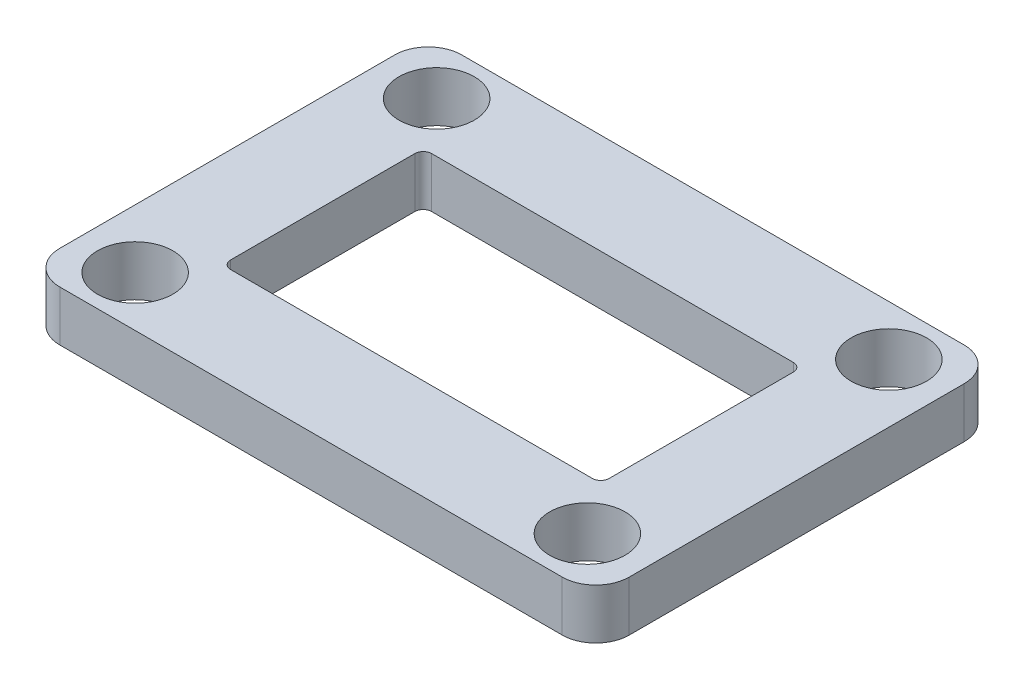
ISO-10303-21;
HEADER;
FILE_DESCRIPTION(('STEP AP214'),'2;1');
FILE_NAME('part.step','',(''),(''),'','','');
FILE_SCHEMA(('AUTOMOTIVE_DESIGN { 1 0 10303 214 1 1 1 1 }'));
ENDSEC;
DATA;
#1=APPLICATION_CONTEXT('core data for automotive mechanical design processes');
#2=APPLICATION_PROTOCOL_DEFINITION('international standard','automotive_design',2000,#1);
#3=PRODUCT_CONTEXT('',#1,'mechanical');
#4=PRODUCT('Part','Part','',(#3));
#5=PRODUCT_RELATED_PRODUCT_CATEGORY('part','',(#4));
#6=PRODUCT_DEFINITION_FORMATION('','',#4);
#7=PRODUCT_DEFINITION_CONTEXT('part definition',#1,'design');
#8=PRODUCT_DEFINITION('design','',#6,#7);
#9=PRODUCT_DEFINITION_SHAPE('','',#8);
#10=(LENGTH_UNIT() NAMED_UNIT(*) SI_UNIT(.MILLI.,.METRE.));
#11=(NAMED_UNIT(*) PLANE_ANGLE_UNIT() SI_UNIT($,.RADIAN.));
#12=(NAMED_UNIT(*) SI_UNIT($,.STERADIAN.) SOLID_ANGLE_UNIT());
#13=UNCERTAINTY_MEASURE_WITH_UNIT(LENGTH_MEASURE(1.E-05),#10,'distance_accuracy_value','');
#14=(GEOMETRIC_REPRESENTATION_CONTEXT(3) GLOBAL_UNCERTAINTY_ASSIGNED_CONTEXT((#13)) GLOBAL_UNIT_ASSIGNED_CONTEXT((#10,
#11,#12)) REPRESENTATION_CONTEXT('',''));
#15=CARTESIAN_POINT('',(0.,0.,0.));
#16=DIRECTION('',(0.,0.,1.));
#17=DIRECTION('',(1.,0.,0.));
#18=AXIS2_PLACEMENT_3D('',#15,#16,#17);
#19=CARTESIAN_POINT('',(0.,3.,0.));
#20=DIRECTION('',(0.,-1.,0.));
#21=DIRECTION('',(0.,0.,-1.));
#22=AXIS2_PLACEMENT_3D('',#19,#20,#21);
#23=PLANE('',#22);
#24=DIRECTION('',(0.,0.,-1.));
#25=VECTOR('',#24,1.);
#26=CARTESIAN_POINT('',(17.,3.,12.));
#27=LINE('',#26,#25);
#28=CARTESIAN_POINT('',(17.,3.,10.));
#29=VERTEX_POINT('',#28);
#30=CARTESIAN_POINT('',(17.,3.,-9.99999999999999));
#31=VERTEX_POINT('',#30);
#32=EDGE_CURVE('E262',#29,#31,#27,.T.);
#33=ORIENTED_EDGE('',*,*,#32,.T.);
#34=CARTESIAN_POINT('',(15.,3.,-10.));
#35=DIRECTION('',(0.,-1.,0.));
#36=DIRECTION('',(0.,0.,-1.));
#37=AXIS2_PLACEMENT_3D('',#34,#35,#36);
#38=CIRCLE('',#37,2.);
#39=CARTESIAN_POINT('',(15.,3.,-12.));
#40=VERTEX_POINT('',#39);
#41=EDGE_CURVE('E241',#31,#40,#38,.F.);
#42=ORIENTED_EDGE('',*,*,#41,.T.);
#43=DIRECTION('',(-1.,0.,0.));
#44=VECTOR('',#43,1.);
#45=CARTESIAN_POINT('',(-17.,3.,-12.));
#46=LINE('',#45,#44);
#47=CARTESIAN_POINT('',(-15.,3.,-12.));
#48=VERTEX_POINT('',#47);
#49=EDGE_CURVE('E270',#40,#48,#46,.T.);
#50=ORIENTED_EDGE('',*,*,#49,.T.);
#51=CARTESIAN_POINT('',(-15.,3.,-9.99999999999999));
#52=DIRECTION('',(0.,-1.,0.));
#53=DIRECTION('',(0.,0.,-1.));
#54=AXIS2_PLACEMENT_3D('',#51,#52,#53);
#55=CIRCLE('',#54,2.);
#56=CARTESIAN_POINT('',(-17.,3.,-9.99999999999999));
#57=VERTEX_POINT('',#56);
#58=EDGE_CURVE('E236',#48,#57,#55,.F.);
#59=ORIENTED_EDGE('',*,*,#58,.T.);
#60=DIRECTION('',(0.,0.,1.));
#61=VECTOR('',#60,1.);
#62=CARTESIAN_POINT('',(-17.,3.,12.));
#63=LINE('',#62,#61);
#64=CARTESIAN_POINT('',(-17.,3.,10.));
#65=VERTEX_POINT('',#64);
#66=EDGE_CURVE('E187',#57,#65,#63,.T.);
#67=ORIENTED_EDGE('',*,*,#66,.T.);
#68=CARTESIAN_POINT('',(-15.,3.,10.));
#69=DIRECTION('',(0.,-1.,0.));
#70=DIRECTION('',(0.,0.,-1.));
#71=AXIS2_PLACEMENT_3D('',#68,#69,#70);
#72=CIRCLE('',#71,2.);
#73=CARTESIAN_POINT('',(-15.,3.,12.));
#74=VERTEX_POINT('',#73);
#75=EDGE_CURVE('E65',#65,#74,#72,.F.);
#76=ORIENTED_EDGE('',*,*,#75,.T.);
#77=DIRECTION('',(1.,0.,0.));
#78=VECTOR('',#77,1.);
#79=CARTESIAN_POINT('',(-17.,3.,12.));
#80=LINE('',#79,#78);
#81=CARTESIAN_POINT('',(15.,3.,12.));
#82=VERTEX_POINT('',#81);
#83=EDGE_CURVE('E183',#74,#82,#80,.T.);
#84=ORIENTED_EDGE('',*,*,#83,.T.);
#85=CARTESIAN_POINT('',(15.,3.,10.));
#86=DIRECTION('',(0.,-1.,0.));
#87=DIRECTION('',(0.,0.,-1.));
#88=AXIS2_PLACEMENT_3D('',#85,#86,#87);
#89=CIRCLE('',#88,2.);
#90=EDGE_CURVE('E239',#82,#29,#89,.F.);
#91=ORIENTED_EDGE('',*,*,#90,.T.);
#92=EDGE_LOOP('',(#33,#42,#50,#59,#67,#76,#84,#91));
#93=FACE_BOUND('',#92,.T.);
#94=DIRECTION('',(0.,0.,-1.));
#95=VECTOR('',#94,1.);
#96=CARTESIAN_POINT('',(11.3,3.,6.));
#97=LINE('',#96,#95);
#98=CARTESIAN_POINT('',(11.3,3.,5.5));
#99=VERTEX_POINT('',#98);
#100=CARTESIAN_POINT('',(11.3,3.,-5.5));
#101=VERTEX_POINT('',#100);
#102=EDGE_CURVE('E179',#99,#101,#97,.T.);
#103=ORIENTED_EDGE('',*,*,#102,.F.);
#104=CARTESIAN_POINT('',(10.8,3.,5.5));
#105=DIRECTION('',(0.,-1.,0.));
#106=DIRECTION('',(0.,0.,-1.));
#107=AXIS2_PLACEMENT_3D('',#104,#105,#106);
#108=CIRCLE('',#107,0.5);
#109=CARTESIAN_POINT('',(10.8,3.,6.));
#110=VERTEX_POINT('',#109);
#111=EDGE_CURVE('E208',#99,#110,#108,.T.);
#112=ORIENTED_EDGE('',*,*,#111,.T.);
#113=DIRECTION('',(1.,0.,0.));
#114=VECTOR('',#113,1.);
#115=CARTESIAN_POINT('',(-11.3,3.,6.));
#116=LINE('',#115,#114);
#117=CARTESIAN_POINT('',(-10.8,3.,6.));
#118=VERTEX_POINT('',#117);
#119=EDGE_CURVE('E267',#118,#110,#116,.T.);
#120=ORIENTED_EDGE('',*,*,#119,.F.);
#121=CARTESIAN_POINT('',(-10.8,3.,5.5));
#122=DIRECTION('',(0.,-1.,0.));
#123=DIRECTION('',(0.,0.,-1.));
#124=AXIS2_PLACEMENT_3D('',#121,#122,#123);
#125=CIRCLE('',#124,0.5);
#126=CARTESIAN_POINT('',(-11.3,3.,5.5));
#127=VERTEX_POINT('',#126);
#128=EDGE_CURVE('E168',#118,#127,#125,.T.);
#129=ORIENTED_EDGE('',*,*,#128,.T.);
#130=DIRECTION('',(0.,0.,1.));
#131=VECTOR('',#130,1.);
#132=CARTESIAN_POINT('',(-11.3,3.,6.));
#133=LINE('',#132,#131);
#134=CARTESIAN_POINT('',(-11.3,3.,-5.5));
#135=VERTEX_POINT('',#134);
#136=EDGE_CURVE('E284',#135,#127,#133,.T.);
#137=ORIENTED_EDGE('',*,*,#136,.F.);
#138=CARTESIAN_POINT('',(-10.8,3.,-5.5));
#139=DIRECTION('',(0.,-1.,0.));
#140=DIRECTION('',(0.,0.,-1.));
#141=AXIS2_PLACEMENT_3D('',#138,#139,#140);
#142=CIRCLE('',#141,0.5);
#143=CARTESIAN_POINT('',(-10.8,3.,-6.));
#144=VERTEX_POINT('',#143);
#145=EDGE_CURVE('E169',#135,#144,#142,.T.);
#146=ORIENTED_EDGE('',*,*,#145,.T.);
#147=DIRECTION('',(-1.,0.,0.));
#148=VECTOR('',#147,1.);
#149=CARTESIAN_POINT('',(-11.3,3.,-6.));
#150=LINE('',#149,#148);
#151=CARTESIAN_POINT('',(10.8,3.,-6.));
#152=VERTEX_POINT('',#151);
#153=EDGE_CURVE('E287',#152,#144,#150,.T.);
#154=ORIENTED_EDGE('',*,*,#153,.F.);
#155=CARTESIAN_POINT('',(10.8,3.,-5.5));
#156=DIRECTION('',(0.,-1.,0.));
#157=DIRECTION('',(0.,0.,-1.));
#158=AXIS2_PLACEMENT_3D('',#155,#156,#157);
#159=CIRCLE('',#158,0.5);
#160=EDGE_CURVE('E212',#152,#101,#159,.T.);
#161=ORIENTED_EDGE('',*,*,#160,.T.);
#162=EDGE_LOOP('',(#103,#112,#120,#129,#137,#146,#154,#161));
#163=FACE_BOUND('',#162,.T.);
#164=CARTESIAN_POINT('',(-13.5,3.,-9.));
#165=DIRECTION('',(0.,1.,0.));
#166=DIRECTION('',(0.,0.,-1.));
#167=AXIS2_PLACEMENT_3D('',#164,#165,#166);
#168=CIRCLE('',#167,2.25);
#169=CARTESIAN_POINT('',(-13.5,3.,-11.25));
#170=VERTEX_POINT('',#169);
#171=EDGE_CURVE('E282',#170,#170,#168,.T.);
#172=ORIENTED_EDGE('',*,*,#171,.F.);
#173=EDGE_LOOP('',(#172));
#174=FACE_BOUND('',#173,.T.);
#175=CARTESIAN_POINT('',(13.5,3.,9.));
#176=DIRECTION('',(0.,1.,0.));
#177=DIRECTION('',(0.,0.,-1.));
#178=AXIS2_PLACEMENT_3D('',#175,#176,#177);
#179=CIRCLE('',#178,2.25);
#180=CARTESIAN_POINT('',(13.5,3.,6.75));
#181=VERTEX_POINT('',#180);
#182=EDGE_CURVE('E295',#181,#181,#179,.T.);
#183=ORIENTED_EDGE('',*,*,#182,.F.);
#184=EDGE_LOOP('',(#183));
#185=FACE_BOUND('',#184,.T.);
#186=CARTESIAN_POINT('',(13.5,3.,-9.00000000000001));
#187=DIRECTION('',(0.,1.,0.));
#188=DIRECTION('',(0.,0.,1.));
#189=AXIS2_PLACEMENT_3D('',#186,#187,#188);
#190=CIRCLE('',#189,2.25);
#191=CARTESIAN_POINT('',(13.5,3.,-6.75000000000001));
#192=VERTEX_POINT('',#191);
#193=EDGE_CURVE('E301',#192,#192,#190,.T.);
#194=ORIENTED_EDGE('',*,*,#193,.F.);
#195=EDGE_LOOP('',(#194));
#196=FACE_BOUND('',#195,.T.);
#197=CARTESIAN_POINT('',(-13.5,3.,9.));
#198=DIRECTION('',(0.,1.,0.));
#199=DIRECTION('',(0.,0.,1.));
#200=AXIS2_PLACEMENT_3D('',#197,#198,#199);
#201=CIRCLE('',#200,2.25);
#202=CARTESIAN_POINT('',(-13.5,3.,11.25));
#203=VERTEX_POINT('',#202);
#204=EDGE_CURVE('E307',#203,#203,#201,.T.);
#205=ORIENTED_EDGE('',*,*,#204,.F.);
#206=EDGE_LOOP('',(#205));
#207=FACE_BOUND('',#206,.T.);
#208=ADVANCED_FACE('F43',(#93,#163,#174,#185,#196,#207),#23,.F.);
#209=CARTESIAN_POINT('',(0.,0.,0.));
#210=DIRECTION('',(0.,-1.,0.));
#211=DIRECTION('',(0.,0.,-1.));
#212=AXIS2_PLACEMENT_3D('',#209,#210,#211);
#213=PLANE('',#212);
#214=CARTESIAN_POINT('',(13.5,0.,-9.00000000000001));
#215=DIRECTION('',(0.,1.,0.));
#216=DIRECTION('',(0.,0.,1.));
#217=AXIS2_PLACEMENT_3D('',#214,#215,#216);
#218=CIRCLE('',#217,2.25);
#219=CARTESIAN_POINT('',(13.5,0.,-6.75000000000001));
#220=VERTEX_POINT('',#219);
#221=EDGE_CURVE('E304',#220,#220,#218,.T.);
#222=ORIENTED_EDGE('',*,*,#221,.T.);
#223=EDGE_LOOP('',(#222));
#224=FACE_BOUND('',#223,.T.);
#225=CARTESIAN_POINT('',(-13.5,0.,-9.));
#226=DIRECTION('',(0.,1.,0.));
#227=DIRECTION('',(0.,0.,-1.));
#228=AXIS2_PLACEMENT_3D('',#225,#226,#227);
#229=CIRCLE('',#228,2.25);
#230=CARTESIAN_POINT('',(-13.5,0.,-11.25));
#231=VERTEX_POINT('',#230);
#232=EDGE_CURVE('E292',#231,#231,#229,.T.);
#233=ORIENTED_EDGE('',*,*,#232,.T.);
#234=EDGE_LOOP('',(#233));
#235=FACE_BOUND('',#234,.T.);
#236=DIRECTION('',(-1.,0.,0.));
#237=VECTOR('',#236,1.);
#238=CARTESIAN_POINT('',(-17.,0.,-12.));
#239=LINE('',#238,#237);
#240=CARTESIAN_POINT('',(15.,0.,-12.));
#241=VERTEX_POINT('',#240);
#242=CARTESIAN_POINT('',(-15.,0.,-12.));
#243=VERTEX_POINT('',#242);
#244=EDGE_CURVE('E261',#241,#243,#239,.T.);
#245=ORIENTED_EDGE('',*,*,#244,.F.);
#246=CARTESIAN_POINT('',(15.,0.,-10.));
#247=DIRECTION('',(0.,-1.,0.));
#248=DIRECTION('',(0.,0.,-1.));
#249=AXIS2_PLACEMENT_3D('',#246,#247,#248);
#250=CIRCLE('',#249,2.);
#251=CARTESIAN_POINT('',(17.,0.,-9.99999999999999));
#252=VERTEX_POINT('',#251);
#253=EDGE_CURVE('E229',#241,#252,#250,.T.);
#254=ORIENTED_EDGE('',*,*,#253,.T.);
#255=DIRECTION('',(0.,0.,-1.));
#256=VECTOR('',#255,1.);
#257=CARTESIAN_POINT('',(17.,0.,12.));
#258=LINE('',#257,#256);
#259=CARTESIAN_POINT('',(17.,0.,10.));
#260=VERTEX_POINT('',#259);
#261=EDGE_CURVE('E263',#260,#252,#258,.T.);
#262=ORIENTED_EDGE('',*,*,#261,.F.);
#263=CARTESIAN_POINT('',(15.,0.,10.));
#264=DIRECTION('',(0.,-1.,0.));
#265=DIRECTION('',(0.,0.,-1.));
#266=AXIS2_PLACEMENT_3D('',#263,#264,#265);
#267=CIRCLE('',#266,2.);
#268=CARTESIAN_POINT('',(15.,0.,12.));
#269=VERTEX_POINT('',#268);
#270=EDGE_CURVE('E227',#260,#269,#267,.T.);
#271=ORIENTED_EDGE('',*,*,#270,.T.);
#272=DIRECTION('',(1.,0.,0.));
#273=VECTOR('',#272,1.);
#274=CARTESIAN_POINT('',(-17.,0.,12.));
#275=LINE('',#274,#273);
#276=CARTESIAN_POINT('',(-15.,0.,12.));
#277=VERTEX_POINT('',#276);
#278=EDGE_CURVE('E190',#277,#269,#275,.T.);
#279=ORIENTED_EDGE('',*,*,#278,.F.);
#280=CARTESIAN_POINT('',(-15.,0.,10.));
#281=DIRECTION('',(0.,-1.,0.));
#282=DIRECTION('',(0.,0.,-1.));
#283=AXIS2_PLACEMENT_3D('',#280,#281,#282);
#284=CIRCLE('',#283,2.);
#285=CARTESIAN_POINT('',(-17.,0.,10.));
#286=VERTEX_POINT('',#285);
#287=EDGE_CURVE('E225',#277,#286,#284,.T.);
#288=ORIENTED_EDGE('',*,*,#287,.T.);
#289=DIRECTION('',(0.,0.,1.));
#290=VECTOR('',#289,1.);
#291=CARTESIAN_POINT('',(-17.,0.,12.));
#292=LINE('',#291,#290);
#293=CARTESIAN_POINT('',(-17.,0.,-9.99999999999999));
#294=VERTEX_POINT('',#293);
#295=EDGE_CURVE('E253',#294,#286,#292,.T.);
#296=ORIENTED_EDGE('',*,*,#295,.F.);
#297=CARTESIAN_POINT('',(-15.,0.,-9.99999999999999));
#298=DIRECTION('',(0.,-1.,0.));
#299=DIRECTION('',(0.,0.,-1.));
#300=AXIS2_PLACEMENT_3D('',#297,#298,#299);
#301=CIRCLE('',#300,2.);
#302=EDGE_CURVE('E223',#294,#243,#301,.T.);
#303=ORIENTED_EDGE('',*,*,#302,.T.);
#304=EDGE_LOOP('',(#245,#254,#262,#271,#279,#288,#296,#303));
#305=FACE_BOUND('',#304,.T.);
#306=DIRECTION('',(0.,0.,1.));
#307=VECTOR('',#306,1.);
#308=CARTESIAN_POINT('',(-11.3,0.,6.));
#309=LINE('',#308,#307);
#310=CARTESIAN_POINT('',(-11.3,0.,-5.5));
#311=VERTEX_POINT('',#310);
#312=CARTESIAN_POINT('',(-11.3,0.,5.5));
#313=VERTEX_POINT('',#312);
#314=EDGE_CURVE('E163',#311,#313,#309,.T.);
#315=ORIENTED_EDGE('',*,*,#314,.T.);
#316=CARTESIAN_POINT('',(-10.8,0.,5.5));
#317=DIRECTION('',(0.,-1.,0.));
#318=DIRECTION('',(0.,0.,-1.));
#319=AXIS2_PLACEMENT_3D('',#316,#317,#318);
#320=CIRCLE('',#319,0.5);
#321=CARTESIAN_POINT('',(-10.8,0.,6.));
#322=VERTEX_POINT('',#321);
#323=EDGE_CURVE('E157',#313,#322,#320,.F.);
#324=ORIENTED_EDGE('',*,*,#323,.T.);
#325=DIRECTION('',(1.,0.,0.));
#326=VECTOR('',#325,1.);
#327=CARTESIAN_POINT('',(-11.3,0.,6.));
#328=LINE('',#327,#326);
#329=CARTESIAN_POINT('',(10.8,0.,6.));
#330=VERTEX_POINT('',#329);
#331=EDGE_CURVE('E161',#322,#330,#328,.T.);
#332=ORIENTED_EDGE('',*,*,#331,.T.);
#333=CARTESIAN_POINT('',(10.8,0.,5.5));
#334=DIRECTION('',(0.,-1.,0.));
#335=DIRECTION('',(0.,0.,-1.));
#336=AXIS2_PLACEMENT_3D('',#333,#334,#335);
#337=CIRCLE('',#336,0.5);
#338=CARTESIAN_POINT('',(11.3,0.,5.5));
#339=VERTEX_POINT('',#338);
#340=EDGE_CURVE('E206',#330,#339,#337,.F.);
#341=ORIENTED_EDGE('',*,*,#340,.T.);
#342=DIRECTION('',(0.,0.,-1.));
#343=VECTOR('',#342,1.);
#344=CARTESIAN_POINT('',(11.3,0.,6.));
#345=LINE('',#344,#343);
#346=CARTESIAN_POINT('',(11.3,0.,-5.5));
#347=VERTEX_POINT('',#346);
#348=EDGE_CURVE('E279',#339,#347,#345,.T.);
#349=ORIENTED_EDGE('',*,*,#348,.T.);
#350=CARTESIAN_POINT('',(10.8,0.,-5.5));
#351=DIRECTION('',(0.,-1.,0.));
#352=DIRECTION('',(0.,0.,-1.));
#353=AXIS2_PLACEMENT_3D('',#350,#351,#352);
#354=CIRCLE('',#353,0.5);
#355=CARTESIAN_POINT('',(10.8,0.,-6.));
#356=VERTEX_POINT('',#355);
#357=EDGE_CURVE('E210',#347,#356,#354,.F.);
#358=ORIENTED_EDGE('',*,*,#357,.T.);
#359=DIRECTION('',(-1.,0.,0.));
#360=VECTOR('',#359,1.);
#361=CARTESIAN_POINT('',(-11.3,0.,-6.));
#362=LINE('',#361,#360);
#363=CARTESIAN_POINT('',(-10.8,0.,-6.));
#364=VERTEX_POINT('',#363);
#365=EDGE_CURVE('E276',#356,#364,#362,.T.);
#366=ORIENTED_EDGE('',*,*,#365,.T.);
#367=CARTESIAN_POINT('',(-10.8,0.,-5.5));
#368=DIRECTION('',(0.,-1.,0.));
#369=DIRECTION('',(0.,0.,-1.));
#370=AXIS2_PLACEMENT_3D('',#367,#368,#369);
#371=CIRCLE('',#370,0.5);
#372=EDGE_CURVE('E214',#364,#311,#371,.F.);
#373=ORIENTED_EDGE('',*,*,#372,.T.);
#374=EDGE_LOOP('',(#315,#324,#332,#341,#349,#358,#366,#373));
#375=FACE_BOUND('',#374,.T.);
#376=CARTESIAN_POINT('',(13.5,0.,9.));
#377=DIRECTION('',(0.,1.,0.));
#378=DIRECTION('',(0.,0.,-1.));
#379=AXIS2_PLACEMENT_3D('',#376,#377,#378);
#380=CIRCLE('',#379,2.25);
#381=CARTESIAN_POINT('',(13.5,0.,6.75));
#382=VERTEX_POINT('',#381);
#383=EDGE_CURVE('E298',#382,#382,#380,.T.);
#384=ORIENTED_EDGE('',*,*,#383,.T.);
#385=EDGE_LOOP('',(#384));
#386=FACE_BOUND('',#385,.T.);
#387=CARTESIAN_POINT('',(-13.5,0.,9.));
#388=DIRECTION('',(0.,1.,0.));
#389=DIRECTION('',(0.,0.,1.));
#390=AXIS2_PLACEMENT_3D('',#387,#388,#389);
#391=CIRCLE('',#390,2.25);
#392=CARTESIAN_POINT('',(-13.5,0.,11.25));
#393=VERTEX_POINT('',#392);
#394=EDGE_CURVE('E310',#393,#393,#391,.T.);
#395=ORIENTED_EDGE('',*,*,#394,.T.);
#396=EDGE_LOOP('',(#395));
#397=FACE_BOUND('',#396,.T.);
#398=ADVANCED_FACE('F159',(#224,#235,#305,#375,#386,#397),#213,.T.);
#399=CARTESIAN_POINT('',(17.,3.,12.));
#400=DIRECTION('',(-1.,0.,0.));
#401=DIRECTION('',(0.,0.,1.));
#402=AXIS2_PLACEMENT_3D('',#399,#400,#401);
#403=PLANE('',#402);
#404=ORIENTED_EDGE('',*,*,#261,.T.);
#405=DIRECTION('',(0.,-1.,0.));
#406=VECTOR('',#405,1.);
#407=CARTESIAN_POINT('',(17.,3.,-9.99999999999999));
#408=LINE('',#407,#406);
#409=EDGE_CURVE('E234',#252,#31,#408,.F.);
#410=ORIENTED_EDGE('',*,*,#409,.T.);
#411=ORIENTED_EDGE('',*,*,#32,.F.);
#412=DIRECTION('',(0.,-1.,0.));
#413=VECTOR('',#412,1.);
#414=CARTESIAN_POINT('',(17.,3.,10.));
#415=LINE('',#414,#413);
#416=EDGE_CURVE('E231',#29,#260,#415,.T.);
#417=ORIENTED_EDGE('',*,*,#416,.T.);
#418=EDGE_LOOP('',(#404,#410,#411,#417));
#419=FACE_BOUND('',#418,.T.);
#420=ADVANCED_FACE('F325',(#419),#403,.F.);
#421=CARTESIAN_POINT('',(-17.,3.,-12.));
#422=DIRECTION('',(0.,0.,1.));
#423=DIRECTION('',(1.,0.,0.));
#424=AXIS2_PLACEMENT_3D('',#421,#422,#423);
#425=PLANE('',#424);
#426=ORIENTED_EDGE('',*,*,#49,.F.);
#427=DIRECTION('',(0.,-1.,0.));
#428=VECTOR('',#427,1.);
#429=CARTESIAN_POINT('',(15.,3.,-12.));
#430=LINE('',#429,#428);
#431=EDGE_CURVE('E220',#40,#241,#430,.T.);
#432=ORIENTED_EDGE('',*,*,#431,.T.);
#433=ORIENTED_EDGE('',*,*,#244,.T.);
#434=DIRECTION('',(0.,-1.,0.));
#435=VECTOR('',#434,1.);
#436=CARTESIAN_POINT('',(-15.,3.,-12.));
#437=LINE('',#436,#435);
#438=EDGE_CURVE('E218',#243,#48,#437,.F.);
#439=ORIENTED_EDGE('',*,*,#438,.T.);
#440=EDGE_LOOP('',(#426,#432,#433,#439));
#441=FACE_BOUND('',#440,.T.);
#442=ADVANCED_FACE('F338',(#441),#425,.F.);
#443=CARTESIAN_POINT('',(-17.,3.,12.));
#444=DIRECTION('',(1.,0.,0.));
#445=DIRECTION('',(0.,0.,-1.));
#446=AXIS2_PLACEMENT_3D('',#443,#444,#445);
#447=PLANE('',#446);
#448=ORIENTED_EDGE('',*,*,#295,.T.);
#449=DIRECTION('',(0.,-1.,0.));
#450=VECTOR('',#449,1.);
#451=CARTESIAN_POINT('',(-17.,3.,10.));
#452=LINE('',#451,#450);
#453=EDGE_CURVE('E11',#286,#65,#452,.F.);
#454=ORIENTED_EDGE('',*,*,#453,.T.);
#455=ORIENTED_EDGE('',*,*,#66,.F.);
#456=DIRECTION('',(0.,-1.,0.));
#457=VECTOR('',#456,1.);
#458=CARTESIAN_POINT('',(-17.,3.,-9.99999999999999));
#459=LINE('',#458,#457);
#460=EDGE_CURVE('E51',#57,#294,#459,.T.);
#461=ORIENTED_EDGE('',*,*,#460,.T.);
#462=EDGE_LOOP('',(#448,#454,#455,#461));
#463=FACE_BOUND('',#462,.T.);
#464=ADVANCED_FACE('F252',(#463),#447,.F.);
#465=CARTESIAN_POINT('',(-17.,3.,12.));
#466=DIRECTION('',(0.,0.,-1.));
#467=DIRECTION('',(-1.,0.,0.));
#468=AXIS2_PLACEMENT_3D('',#465,#466,#467);
#469=PLANE('',#468);
#470=ORIENTED_EDGE('',*,*,#278,.T.);
#471=DIRECTION('',(0.,-1.,0.));
#472=VECTOR('',#471,1.);
#473=CARTESIAN_POINT('',(15.,3.,12.));
#474=LINE('',#473,#472);
#475=EDGE_CURVE('E58',#269,#82,#474,.F.);
#476=ORIENTED_EDGE('',*,*,#475,.T.);
#477=ORIENTED_EDGE('',*,*,#83,.F.);
#478=DIRECTION('',(0.,-1.,0.));
#479=VECTOR('',#478,1.);
#480=CARTESIAN_POINT('',(-15.,3.,12.));
#481=LINE('',#480,#479);
#482=EDGE_CURVE('E243',#74,#277,#481,.T.);
#483=ORIENTED_EDGE('',*,*,#482,.T.);
#484=EDGE_LOOP('',(#470,#476,#477,#483));
#485=FACE_BOUND('',#484,.T.);
#486=ADVANCED_FACE('F333',(#485),#469,.F.);
#487=CARTESIAN_POINT('',(11.3,3.,6.));
#488=DIRECTION('',(-1.,0.,0.));
#489=DIRECTION('',(0.,0.,1.));
#490=AXIS2_PLACEMENT_3D('',#487,#488,#489);
#491=PLANE('',#490);
#492=ORIENTED_EDGE('',*,*,#348,.F.);
#493=DIRECTION('',(0.,-1.,0.));
#494=VECTOR('',#493,1.);
#495=CARTESIAN_POINT('',(11.3,3.,5.5));
#496=LINE('',#495,#494);
#497=EDGE_CURVE('E195',#339,#99,#496,.F.);
#498=ORIENTED_EDGE('',*,*,#497,.T.);
#499=ORIENTED_EDGE('',*,*,#102,.T.);
#500=DIRECTION('',(0.,-1.,0.));
#501=VECTOR('',#500,1.);
#502=CARTESIAN_POINT('',(11.3,0.,-5.5));
#503=LINE('',#502,#501);
#504=EDGE_CURVE('E185',#101,#347,#503,.T.);
#505=ORIENTED_EDGE('',*,*,#504,.T.);
#506=EDGE_LOOP('',(#492,#498,#499,#505));
#507=FACE_BOUND('',#506,.T.);
#508=ADVANCED_FACE('F330',(#507),#491,.T.);
#509=CARTESIAN_POINT('',(-11.3,3.,-6.));
#510=DIRECTION('',(0.,0.,1.));
#511=DIRECTION('',(1.,0.,0.));
#512=AXIS2_PLACEMENT_3D('',#509,#510,#511);
#513=PLANE('',#512);
#514=ORIENTED_EDGE('',*,*,#365,.F.);
#515=DIRECTION('',(0.,-1.,0.));
#516=VECTOR('',#515,1.);
#517=CARTESIAN_POINT('',(10.8,3.,-6.));
#518=LINE('',#517,#516);
#519=EDGE_CURVE('E200',#356,#152,#518,.F.);
#520=ORIENTED_EDGE('',*,*,#519,.T.);
#521=ORIENTED_EDGE('',*,*,#153,.T.);
#522=DIRECTION('',(0.,-1.,0.));
#523=VECTOR('',#522,1.);
#524=CARTESIAN_POINT('',(-10.8,0.,-6.));
#525=LINE('',#524,#523);
#526=EDGE_CURVE('E197',#144,#364,#525,.T.);
#527=ORIENTED_EDGE('',*,*,#526,.T.);
#528=EDGE_LOOP('',(#514,#520,#521,#527));
#529=FACE_BOUND('',#528,.T.);
#530=ADVANCED_FACE('F481',(#529),#513,.T.);
#531=CARTESIAN_POINT('',(-11.3,3.,6.));
#532=DIRECTION('',(1.,0.,0.));
#533=DIRECTION('',(0.,0.,-1.));
#534=AXIS2_PLACEMENT_3D('',#531,#532,#533);
#535=PLANE('',#534);
#536=ORIENTED_EDGE('',*,*,#314,.F.);
#537=DIRECTION('',(0.,-1.,0.));
#538=VECTOR('',#537,1.);
#539=CARTESIAN_POINT('',(-11.3,3.,-5.5));
#540=LINE('',#539,#538);
#541=EDGE_CURVE('E204',#311,#135,#540,.F.);
#542=ORIENTED_EDGE('',*,*,#541,.T.);
#543=ORIENTED_EDGE('',*,*,#136,.T.);
#544=DIRECTION('',(0.,-1.,0.));
#545=VECTOR('',#544,1.);
#546=CARTESIAN_POINT('',(-11.3,0.,5.5));
#547=LINE('',#546,#545);
#548=EDGE_CURVE('E202',#127,#313,#547,.T.);
#549=ORIENTED_EDGE('',*,*,#548,.T.);
#550=EDGE_LOOP('',(#536,#542,#543,#549));
#551=FACE_BOUND('',#550,.T.);
#552=ADVANCED_FACE('F472',(#551),#535,.T.);
#553=CARTESIAN_POINT('',(-11.3,3.,6.));
#554=DIRECTION('',(0.,0.,-1.));
#555=DIRECTION('',(-1.,0.,0.));
#556=AXIS2_PLACEMENT_3D('',#553,#554,#555);
#557=PLANE('',#556);
#558=ORIENTED_EDGE('',*,*,#119,.T.);
#559=DIRECTION('',(0.,-1.,0.));
#560=VECTOR('',#559,1.);
#561=CARTESIAN_POINT('',(10.8,0.,6.));
#562=LINE('',#561,#560);
#563=EDGE_CURVE('E178',#110,#330,#562,.T.);
#564=ORIENTED_EDGE('',*,*,#563,.T.);
#565=ORIENTED_EDGE('',*,*,#331,.F.);
#566=DIRECTION('',(0.,-1.,0.));
#567=VECTOR('',#566,1.);
#568=CARTESIAN_POINT('',(-10.8,3.,6.));
#569=LINE('',#568,#567);
#570=EDGE_CURVE('E175',#322,#118,#569,.F.);
#571=ORIENTED_EDGE('',*,*,#570,.T.);
#572=EDGE_LOOP('',(#558,#564,#565,#571));
#573=FACE_BOUND('',#572,.T.);
#574=ADVANCED_FACE('F174',(#573),#557,.T.);
#575=CARTESIAN_POINT('',(-13.5,3.,-9.));
#576=DIRECTION('',(0.,-1.,0.));
#577=DIRECTION('',(0.,0.,-1.));
#578=AXIS2_PLACEMENT_3D('',#575,#576,#577);
#579=CYLINDRICAL_SURFACE('',#578,2.25);
#580=ORIENTED_EDGE('',*,*,#171,.T.);
#581=EDGE_LOOP('',(#580));
#582=FACE_BOUND('',#581,.T.);
#583=ORIENTED_EDGE('',*,*,#232,.F.);
#584=EDGE_LOOP('',(#583));
#585=FACE_BOUND('',#584,.T.);
#586=ADVANCED_FACE('F454',(#582,#585),#579,.F.);
#587=CARTESIAN_POINT('',(13.5,3.,9.));
#588=DIRECTION('',(0.,-1.,0.));
#589=DIRECTION('',(0.,0.,-1.));
#590=AXIS2_PLACEMENT_3D('',#587,#588,#589);
#591=CYLINDRICAL_SURFACE('',#590,2.25);
#592=ORIENTED_EDGE('',*,*,#182,.T.);
#593=EDGE_LOOP('',(#592));
#594=FACE_BOUND('',#593,.T.);
#595=ORIENTED_EDGE('',*,*,#383,.F.);
#596=EDGE_LOOP('',(#595));
#597=FACE_BOUND('',#596,.T.);
#598=ADVANCED_FACE('F444',(#594,#597),#591,.F.);
#599=CARTESIAN_POINT('',(13.5,3.,-9.00000000000001));
#600=DIRECTION('',(0.,-1.,0.));
#601=DIRECTION('',(0.,0.,-1.));
#602=AXIS2_PLACEMENT_3D('',#599,#600,#601);
#603=CYLINDRICAL_SURFACE('',#602,2.25);
#604=ORIENTED_EDGE('',*,*,#193,.T.);
#605=EDGE_LOOP('',(#604));
#606=FACE_BOUND('',#605,.T.);
#607=ORIENTED_EDGE('',*,*,#221,.F.);
#608=EDGE_LOOP('',(#607));
#609=FACE_BOUND('',#608,.T.);
#610=ADVANCED_FACE('F434',(#606,#609),#603,.F.);
#611=CARTESIAN_POINT('',(-13.5,3.,9.));
#612=DIRECTION('',(0.,-1.,0.));
#613=DIRECTION('',(0.,0.,-1.));
#614=AXIS2_PLACEMENT_3D('',#611,#612,#613);
#615=CYLINDRICAL_SURFACE('',#614,2.25);
#616=ORIENTED_EDGE('',*,*,#204,.T.);
#617=EDGE_LOOP('',(#616));
#618=FACE_BOUND('',#617,.T.);
#619=ORIENTED_EDGE('',*,*,#394,.F.);
#620=EDGE_LOOP('',(#619));
#621=FACE_BOUND('',#620,.T.);
#622=ADVANCED_FACE('F316',(#618,#621),#615,.F.);
#623=CARTESIAN_POINT('',(10.8,3.,5.5));
#624=DIRECTION('',(0.,1.,0.));
#625=DIRECTION('',(0.,0.,1.));
#626=AXIS2_PLACEMENT_3D('',#623,#624,#625);
#627=CYLINDRICAL_SURFACE('',#626,0.5);
#628=ORIENTED_EDGE('',*,*,#111,.F.);
#629=ORIENTED_EDGE('',*,*,#497,.F.);
#630=ORIENTED_EDGE('',*,*,#340,.F.);
#631=ORIENTED_EDGE('',*,*,#563,.F.);
#632=EDGE_LOOP('',(#628,#629,#630,#631));
#633=FACE_BOUND('',#632,.T.);
#634=ADVANCED_FACE('F345',(#633),#627,.F.);
#635=CARTESIAN_POINT('',(10.8,3.,-5.5));
#636=DIRECTION('',(0.,1.,0.));
#637=DIRECTION('',(0.,0.,1.));
#638=AXIS2_PLACEMENT_3D('',#635,#636,#637);
#639=CYLINDRICAL_SURFACE('',#638,0.5);
#640=ORIENTED_EDGE('',*,*,#160,.F.);
#641=ORIENTED_EDGE('',*,*,#519,.F.);
#642=ORIENTED_EDGE('',*,*,#357,.F.);
#643=ORIENTED_EDGE('',*,*,#504,.F.);
#644=EDGE_LOOP('',(#640,#641,#642,#643));
#645=FACE_BOUND('',#644,.T.);
#646=ADVANCED_FACE('F348',(#645),#639,.F.);
#647=CARTESIAN_POINT('',(-10.8,3.,-5.5));
#648=DIRECTION('',(0.,1.,0.));
#649=DIRECTION('',(0.,0.,1.));
#650=AXIS2_PLACEMENT_3D('',#647,#648,#649);
#651=CYLINDRICAL_SURFACE('',#650,0.5);
#652=ORIENTED_EDGE('',*,*,#145,.F.);
#653=ORIENTED_EDGE('',*,*,#541,.F.);
#654=ORIENTED_EDGE('',*,*,#372,.F.);
#655=ORIENTED_EDGE('',*,*,#526,.F.);
#656=EDGE_LOOP('',(#652,#653,#654,#655));
#657=FACE_BOUND('',#656,.T.);
#658=ADVANCED_FACE('F352',(#657),#651,.F.);
#659=CARTESIAN_POINT('',(-10.8,3.,5.5));
#660=DIRECTION('',(0.,1.,0.));
#661=DIRECTION('',(0.,0.,1.));
#662=AXIS2_PLACEMENT_3D('',#659,#660,#661);
#663=CYLINDRICAL_SURFACE('',#662,0.5);
#664=ORIENTED_EDGE('',*,*,#128,.F.);
#665=ORIENTED_EDGE('',*,*,#570,.F.);
#666=ORIENTED_EDGE('',*,*,#323,.F.);
#667=ORIENTED_EDGE('',*,*,#548,.F.);
#668=EDGE_LOOP('',(#664,#665,#666,#667));
#669=FACE_BOUND('',#668,.T.);
#670=ADVANCED_FACE('F182',(#669),#663,.F.);
#671=CARTESIAN_POINT('',(15.,3.,-10.));
#672=DIRECTION('',(0.,-1.,0.));
#673=DIRECTION('',(0.,0.,-1.));
#674=AXIS2_PLACEMENT_3D('',#671,#672,#673);
#675=CYLINDRICAL_SURFACE('',#674,2.);
#676=ORIENTED_EDGE('',*,*,#41,.F.);
#677=ORIENTED_EDGE('',*,*,#409,.F.);
#678=ORIENTED_EDGE('',*,*,#253,.F.);
#679=ORIENTED_EDGE('',*,*,#431,.F.);
#680=EDGE_LOOP('',(#676,#677,#678,#679));
#681=FACE_BOUND('',#680,.T.);
#682=ADVANCED_FACE('F358',(#681),#675,.T.);
#683=CARTESIAN_POINT('',(15.,3.,10.));
#684=DIRECTION('',(0.,-1.,0.));
#685=DIRECTION('',(0.,0.,-1.));
#686=AXIS2_PLACEMENT_3D('',#683,#684,#685);
#687=CYLINDRICAL_SURFACE('',#686,2.);
#688=ORIENTED_EDGE('',*,*,#90,.F.);
#689=ORIENTED_EDGE('',*,*,#475,.F.);
#690=ORIENTED_EDGE('',*,*,#270,.F.);
#691=ORIENTED_EDGE('',*,*,#416,.F.);
#692=EDGE_LOOP('',(#688,#689,#690,#691));
#693=FACE_BOUND('',#692,.T.);
#694=ADVANCED_FACE('F361',(#693),#687,.T.);
#695=CARTESIAN_POINT('',(-15.,3.,10.));
#696=DIRECTION('',(0.,-1.,0.));
#697=DIRECTION('',(0.,0.,-1.));
#698=AXIS2_PLACEMENT_3D('',#695,#696,#697);
#699=CYLINDRICAL_SURFACE('',#698,2.);
#700=ORIENTED_EDGE('',*,*,#75,.F.);
#701=ORIENTED_EDGE('',*,*,#453,.F.);
#702=ORIENTED_EDGE('',*,*,#287,.F.);
#703=ORIENTED_EDGE('',*,*,#482,.F.);
#704=EDGE_LOOP('',(#700,#701,#702,#703));
#705=FACE_BOUND('',#704,.T.);
#706=ADVANCED_FACE('F364',(#705),#699,.T.);
#707=CARTESIAN_POINT('',(-15.,3.,-9.99999999999999));
#708=DIRECTION('',(0.,-1.,0.));
#709=DIRECTION('',(0.,0.,-1.));
#710=AXIS2_PLACEMENT_3D('',#707,#708,#709);
#711=CYLINDRICAL_SURFACE('',#710,2.);
#712=ORIENTED_EDGE('',*,*,#58,.F.);
#713=ORIENTED_EDGE('',*,*,#438,.F.);
#714=ORIENTED_EDGE('',*,*,#302,.F.);
#715=ORIENTED_EDGE('',*,*,#460,.F.);
#716=EDGE_LOOP('',(#712,#713,#714,#715));
#717=FACE_BOUND('',#716,.T.);
#718=ADVANCED_FACE('F45',(#717),#711,.T.);
#719=CLOSED_SHELL('',(#208,#398,#420,#442,#464,#486,#508,#530,#552,#574,#586,#598,#610,#622,
#634,#646,#658,#670,#682,#694,#706,#718));
#720=MANIFOLD_SOLID_BREP('B2',#719);
#721=ADVANCED_BREP_SHAPE_REPRESENTATION('',(#18,#720),#14);
#722=SHAPE_DEFINITION_REPRESENTATION(#9,#721);
ENDSEC;
END-ISO-10303-21;
